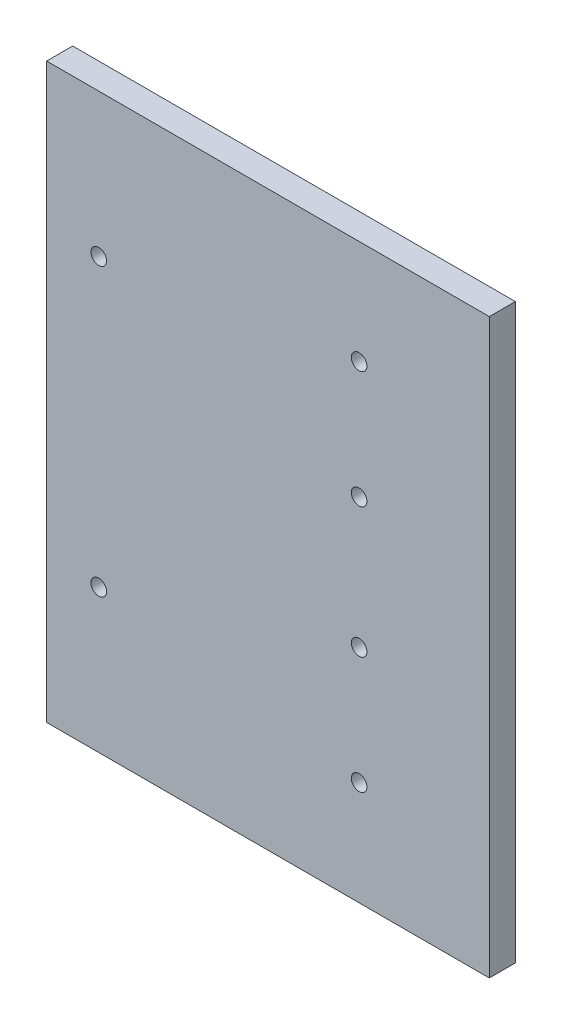
ISO-10303-21;
HEADER;
FILE_DESCRIPTION(('STEP AP214'),'2;1');
FILE_NAME('part.step','',(''),(''),'','','');
FILE_SCHEMA(('AUTOMOTIVE_DESIGN { 1 0 10303 214 1 1 1 1 }'));
ENDSEC;
DATA;
#1=APPLICATION_CONTEXT('core data for automotive mechanical design processes');
#2=APPLICATION_PROTOCOL_DEFINITION('international standard','automotive_design',2000,#1);
#3=PRODUCT_CONTEXT('',#1,'mechanical');
#4=PRODUCT('Part','Part','',(#3));
#5=PRODUCT_RELATED_PRODUCT_CATEGORY('part','',(#4));
#6=PRODUCT_DEFINITION_FORMATION('','',#4);
#7=PRODUCT_DEFINITION_CONTEXT('part definition',#1,'design');
#8=PRODUCT_DEFINITION('design','',#6,#7);
#9=PRODUCT_DEFINITION_SHAPE('','',#8);
#10=(LENGTH_UNIT() NAMED_UNIT(*) SI_UNIT(.MILLI.,.METRE.));
#11=(NAMED_UNIT(*) PLANE_ANGLE_UNIT() SI_UNIT($,.RADIAN.));
#12=(NAMED_UNIT(*) SI_UNIT($,.STERADIAN.) SOLID_ANGLE_UNIT());
#13=UNCERTAINTY_MEASURE_WITH_UNIT(LENGTH_MEASURE(1.E-05),#10,'distance_accuracy_value','');
#14=(GEOMETRIC_REPRESENTATION_CONTEXT(3) GLOBAL_UNCERTAINTY_ASSIGNED_CONTEXT((#13)) GLOBAL_UNIT_ASSIGNED_CONTEXT((#10,
#11,#12)) REPRESENTATION_CONTEXT('',''));
#15=CARTESIAN_POINT('',(0.,0.,0.));
#16=DIRECTION('',(0.,0.,1.));
#17=DIRECTION('',(1.,0.,0.));
#18=AXIS2_PLACEMENT_3D('',#15,#16,#17);
#19=CARTESIAN_POINT('',(-85.,-55.,5.));
#20=DIRECTION('',(1.,0.,0.));
#21=DIRECTION('',(0.,0.,-1.));
#22=AXIS2_PLACEMENT_3D('',#19,#20,#21);
#23=PLANE('',#22);
#24=DIRECTION('',(0.,-1.,0.));
#25=VECTOR('',#24,1.);
#26=CARTESIAN_POINT('',(-85.,-55.,0.));
#27=LINE('',#26,#25);
#28=CARTESIAN_POINT('',(-85.,55.,0.));
#29=VERTEX_POINT('',#28);
#30=CARTESIAN_POINT('',(-85.,-55.,0.));
#31=VERTEX_POINT('',#30);
#32=EDGE_CURVE('E86',#29,#31,#27,.T.);
#33=ORIENTED_EDGE('',*,*,#32,.T.);
#34=DIRECTION('',(0.,0.,-1.));
#35=VECTOR('',#34,1.);
#36=CARTESIAN_POINT('',(-85.,-55.,5.));
#37=LINE('',#36,#35);
#38=CARTESIAN_POINT('',(-85.,-55.,5.));
#39=VERTEX_POINT('',#38);
#40=EDGE_CURVE('E41',#39,#31,#37,.T.);
#41=ORIENTED_EDGE('',*,*,#40,.F.);
#42=DIRECTION('',(0.,-1.,0.));
#43=VECTOR('',#42,1.);
#44=CARTESIAN_POINT('',(-85.,-55.,5.));
#45=LINE('',#44,#43);
#46=CARTESIAN_POINT('',(-85.,55.,5.));
#47=VERTEX_POINT('',#46);
#48=EDGE_CURVE('E80',#47,#39,#45,.T.);
#49=ORIENTED_EDGE('',*,*,#48,.F.);
#50=DIRECTION('',(0.,0.,-1.));
#51=VECTOR('',#50,1.);
#52=CARTESIAN_POINT('',(-85.,55.,5.));
#53=LINE('',#52,#51);
#54=EDGE_CURVE('E73',#47,#29,#53,.T.);
#55=ORIENTED_EDGE('',*,*,#54,.T.);
#56=EDGE_LOOP('',(#33,#41,#49,#55));
#57=FACE_BOUND('',#56,.T.);
#58=ADVANCED_FACE('F34',(#57),#23,.F.);
#59=CARTESIAN_POINT('',(85.,-55.,5.));
#60=DIRECTION('',(0.,1.,0.));
#61=DIRECTION('',(-1.,0.,0.));
#62=AXIS2_PLACEMENT_3D('',#59,#60,#61);
#63=PLANE('',#62);
#64=DIRECTION('',(1.,0.,0.));
#65=VECTOR('',#64,1.);
#66=CARTESIAN_POINT('',(85.,-55.,0.));
#67=LINE('',#66,#65);
#68=CARTESIAN_POINT('',(0.,-55.,0.));
#69=VERTEX_POINT('',#68);
#70=EDGE_CURVE('E81',#31,#69,#67,.T.);
#71=ORIENTED_EDGE('',*,*,#70,.T.);
#72=DIRECTION('',(0.,0.,1.));
#73=VECTOR('',#72,1.);
#74=CARTESIAN_POINT('',(0.,-55.,5.));
#75=LINE('',#74,#73);
#76=CARTESIAN_POINT('',(0.,-55.,5.));
#77=VERTEX_POINT('',#76);
#78=EDGE_CURVE('E48',#69,#77,#75,.T.);
#79=ORIENTED_EDGE('',*,*,#78,.T.);
#80=DIRECTION('',(1.,0.,0.));
#81=VECTOR('',#80,1.);
#82=CARTESIAN_POINT('',(85.,-55.,5.));
#83=LINE('',#82,#81);
#84=EDGE_CURVE('E102',#39,#77,#83,.T.);
#85=ORIENTED_EDGE('',*,*,#84,.F.);
#86=ORIENTED_EDGE('',*,*,#40,.T.);
#87=EDGE_LOOP('',(#71,#79,#85,#86));
#88=FACE_BOUND('',#87,.T.);
#89=ADVANCED_FACE('F100',(#88),#63,.F.);
#90=CARTESIAN_POINT('',(85.,55.,5.));
#91=DIRECTION('',(0.,-1.,0.));
#92=DIRECTION('',(1.,0.,0.));
#93=AXIS2_PLACEMENT_3D('',#90,#91,#92);
#94=PLANE('',#93);
#95=DIRECTION('',(-1.,0.,0.));
#96=VECTOR('',#95,1.);
#97=CARTESIAN_POINT('',(85.,55.,5.));
#98=LINE('',#97,#96);
#99=CARTESIAN_POINT('',(0.,55.,5.));
#100=VERTEX_POINT('',#99);
#101=EDGE_CURVE('E56',#100,#47,#98,.T.);
#102=ORIENTED_EDGE('',*,*,#101,.F.);
#103=DIRECTION('',(0.,0.,-1.));
#104=VECTOR('',#103,1.);
#105=CARTESIAN_POINT('',(0.,55.,5.));
#106=LINE('',#105,#104);
#107=CARTESIAN_POINT('',(0.,55.,0.));
#108=VERTEX_POINT('',#107);
#109=EDGE_CURVE('E77',#100,#108,#106,.T.);
#110=ORIENTED_EDGE('',*,*,#109,.T.);
#111=DIRECTION('',(-1.,0.,0.));
#112=VECTOR('',#111,1.);
#113=CARTESIAN_POINT('',(85.,55.,0.));
#114=LINE('',#113,#112);
#115=EDGE_CURVE('E70',#108,#29,#114,.T.);
#116=ORIENTED_EDGE('',*,*,#115,.T.);
#117=ORIENTED_EDGE('',*,*,#54,.F.);
#118=EDGE_LOOP('',(#102,#110,#116,#117));
#119=FACE_BOUND('',#118,.T.);
#120=ADVANCED_FACE('F72',(#119),#94,.F.);
#121=CARTESIAN_POINT('',(0.,0.,5.));
#122=DIRECTION('',(0.,0.,1.));
#123=DIRECTION('',(1.,0.,0.));
#124=AXIS2_PLACEMENT_3D('',#121,#122,#123);
#125=PLANE('',#124);
#126=DIRECTION('',(0.,-1.,0.));
#127=VECTOR('',#126,1.);
#128=CARTESIAN_POINT('',(0.,0.,5.));
#129=LINE('',#128,#127);
#130=EDGE_CURVE('E126',#100,#77,#129,.T.);
#131=ORIENTED_EDGE('',*,*,#130,.F.);
#132=ORIENTED_EDGE('',*,*,#101,.T.);
#133=ORIENTED_EDGE('',*,*,#48,.T.);
#134=ORIENTED_EDGE('',*,*,#84,.T.);
#135=EDGE_LOOP('',(#131,#132,#133,#134));
#136=FACE_BOUND('',#135,.T.);
#137=CARTESIAN_POINT('',(-25.,12.5,5.));
#138=DIRECTION('',(0.,0.,1.));
#139=DIRECTION('',(-1.,0.,0.));
#140=AXIS2_PLACEMENT_3D('',#137,#138,#139);
#141=CIRCLE('',#140,1.5);
#142=CARTESIAN_POINT('',(-26.5,12.5,5.));
#143=VERTEX_POINT('',#142);
#144=EDGE_CURVE('E135',#143,#143,#141,.T.);
#145=ORIENTED_EDGE('',*,*,#144,.F.);
#146=EDGE_LOOP('',(#145));
#147=FACE_BOUND('',#146,.T.);
#148=CARTESIAN_POINT('',(-25.,-12.5,5.));
#149=DIRECTION('',(0.,0.,1.));
#150=DIRECTION('',(1.,0.,0.));
#151=AXIS2_PLACEMENT_3D('',#148,#149,#150);
#152=CIRCLE('',#151,1.5);
#153=CARTESIAN_POINT('',(-23.5,-12.5,5.));
#154=VERTEX_POINT('',#153);
#155=EDGE_CURVE('E129',#154,#154,#152,.T.);
#156=ORIENTED_EDGE('',*,*,#155,.F.);
#157=EDGE_LOOP('',(#156));
#158=FACE_BOUND('',#157,.T.);
#159=CARTESIAN_POINT('',(-25.,-35.,5.));
#160=DIRECTION('',(0.,0.,1.));
#161=DIRECTION('',(-1.,0.,0.));
#162=AXIS2_PLACEMENT_3D('',#159,#160,#161);
#163=CIRCLE('',#162,1.5);
#164=CARTESIAN_POINT('',(-26.5,-35.,5.));
#165=VERTEX_POINT('',#164);
#166=EDGE_CURVE('E122',#165,#165,#163,.T.);
#167=ORIENTED_EDGE('',*,*,#166,.F.);
#168=EDGE_LOOP('',(#167));
#169=FACE_BOUND('',#168,.T.);
#170=CARTESIAN_POINT('',(-25.,35.,5.));
#171=DIRECTION('',(0.,0.,1.));
#172=DIRECTION('',(1.,0.,0.));
#173=AXIS2_PLACEMENT_3D('',#170,#171,#172);
#174=CIRCLE('',#173,1.5);
#175=CARTESIAN_POINT('',(-23.5,35.,5.));
#176=VERTEX_POINT('',#175);
#177=EDGE_CURVE('E116',#176,#176,#174,.T.);
#178=ORIENTED_EDGE('',*,*,#177,.F.);
#179=EDGE_LOOP('',(#178));
#180=FACE_BOUND('',#179,.T.);
#181=CARTESIAN_POINT('',(-75.,-27.5,5.));
#182=DIRECTION('',(0.,0.,1.));
#183=DIRECTION('',(-1.,0.,0.));
#184=AXIS2_PLACEMENT_3D('',#181,#182,#183);
#185=CIRCLE('',#184,1.5);
#186=CARTESIAN_POINT('',(-76.5,-27.5,5.));
#187=VERTEX_POINT('',#186);
#188=EDGE_CURVE('E110',#187,#187,#185,.T.);
#189=ORIENTED_EDGE('',*,*,#188,.F.);
#190=EDGE_LOOP('',(#189));
#191=FACE_BOUND('',#190,.T.);
#192=CARTESIAN_POINT('',(-75.,27.5,5.));
#193=DIRECTION('',(0.,0.,1.));
#194=DIRECTION('',(1.,0.,0.));
#195=AXIS2_PLACEMENT_3D('',#192,#193,#194);
#196=CIRCLE('',#195,1.5);
#197=CARTESIAN_POINT('',(-73.5,27.5,5.));
#198=VERTEX_POINT('',#197);
#199=EDGE_CURVE('E95',#198,#198,#196,.T.);
#200=ORIENTED_EDGE('',*,*,#199,.F.);
#201=EDGE_LOOP('',(#200));
#202=FACE_BOUND('',#201,.T.);
#203=ADVANCED_FACE('F103',(#136,#147,#158,#169,#180,#191,#202),#125,.T.);
#204=CARTESIAN_POINT('',(0.,0.,0.));
#205=DIRECTION('',(0.,0.,1.));
#206=DIRECTION('',(1.,0.,0.));
#207=AXIS2_PLACEMENT_3D('',#204,#205,#206);
#208=PLANE('',#207);
#209=CARTESIAN_POINT('',(-25.,12.5,0.));
#210=DIRECTION('',(0.,0.,1.));
#211=DIRECTION('',(-1.,0.,0.));
#212=AXIS2_PLACEMENT_3D('',#209,#210,#211);
#213=CIRCLE('',#212,1.5);
#214=CARTESIAN_POINT('',(-26.5,12.5,0.));
#215=VERTEX_POINT('',#214);
#216=EDGE_CURVE('E119',#215,#215,#213,.T.);
#217=ORIENTED_EDGE('',*,*,#216,.T.);
#218=EDGE_LOOP('',(#217));
#219=FACE_BOUND('',#218,.T.);
#220=CARTESIAN_POINT('',(-25.,-12.5,0.));
#221=DIRECTION('',(0.,0.,1.));
#222=DIRECTION('',(1.,0.,0.));
#223=AXIS2_PLACEMENT_3D('',#220,#221,#222);
#224=CIRCLE('',#223,1.5);
#225=CARTESIAN_POINT('',(-23.5,-12.5,0.));
#226=VERTEX_POINT('',#225);
#227=EDGE_CURVE('E132',#226,#226,#224,.T.);
#228=ORIENTED_EDGE('',*,*,#227,.T.);
#229=EDGE_LOOP('',(#228));
#230=FACE_BOUND('',#229,.T.);
#231=CARTESIAN_POINT('',(-25.,-35.,0.));
#232=DIRECTION('',(0.,0.,1.));
#233=DIRECTION('',(-1.,0.,0.));
#234=AXIS2_PLACEMENT_3D('',#231,#232,#233);
#235=CIRCLE('',#234,1.5);
#236=CARTESIAN_POINT('',(-26.5,-35.,0.));
#237=VERTEX_POINT('',#236);
#238=EDGE_CURVE('E125',#237,#237,#235,.T.);
#239=ORIENTED_EDGE('',*,*,#238,.T.);
#240=EDGE_LOOP('',(#239));
#241=FACE_BOUND('',#240,.T.);
#242=CARTESIAN_POINT('',(-25.,35.,0.));
#243=DIRECTION('',(0.,0.,1.));
#244=DIRECTION('',(1.,0.,0.));
#245=AXIS2_PLACEMENT_3D('',#242,#243,#244);
#246=CIRCLE('',#245,1.5);
#247=CARTESIAN_POINT('',(-23.5,35.,0.));
#248=VERTEX_POINT('',#247);
#249=EDGE_CURVE('E113',#248,#248,#246,.T.);
#250=ORIENTED_EDGE('',*,*,#249,.T.);
#251=EDGE_LOOP('',(#250));
#252=FACE_BOUND('',#251,.T.);
#253=CARTESIAN_POINT('',(-75.,-27.5,0.));
#254=DIRECTION('',(0.,0.,1.));
#255=DIRECTION('',(-1.,0.,0.));
#256=AXIS2_PLACEMENT_3D('',#253,#254,#255);
#257=CIRCLE('',#256,1.5);
#258=CARTESIAN_POINT('',(-76.5,-27.5,0.));
#259=VERTEX_POINT('',#258);
#260=EDGE_CURVE('E108',#259,#259,#257,.T.);
#261=ORIENTED_EDGE('',*,*,#260,.T.);
#262=EDGE_LOOP('',(#261));
#263=FACE_BOUND('',#262,.T.);
#264=CARTESIAN_POINT('',(-75.,27.5,0.));
#265=DIRECTION('',(0.,0.,1.));
#266=DIRECTION('',(1.,0.,0.));
#267=AXIS2_PLACEMENT_3D('',#264,#265,#266);
#268=CIRCLE('',#267,1.5);
#269=CARTESIAN_POINT('',(-73.5,27.5,0.));
#270=VERTEX_POINT('',#269);
#271=EDGE_CURVE('E91',#270,#270,#268,.T.);
#272=ORIENTED_EDGE('',*,*,#271,.T.);
#273=EDGE_LOOP('',(#272));
#274=FACE_BOUND('',#273,.T.);
#275=ORIENTED_EDGE('',*,*,#115,.F.);
#276=DIRECTION('',(0.,-1.,0.));
#277=VECTOR('',#276,1.);
#278=CARTESIAN_POINT('',(0.,0.,0.));
#279=LINE('',#278,#277);
#280=EDGE_CURVE('E11',#108,#69,#279,.T.);
#281=ORIENTED_EDGE('',*,*,#280,.T.);
#282=ORIENTED_EDGE('',*,*,#70,.F.);
#283=ORIENTED_EDGE('',*,*,#32,.F.);
#284=EDGE_LOOP('',(#275,#281,#282,#283));
#285=FACE_BOUND('',#284,.T.);
#286=ADVANCED_FACE('F88',(#219,#230,#241,#252,#263,#274,#285),#208,.F.);
#287=CARTESIAN_POINT('',(-75.,27.5,0.));
#288=DIRECTION('',(0.,0.,1.));
#289=DIRECTION('',(1.,0.,0.));
#290=AXIS2_PLACEMENT_3D('',#287,#288,#289);
#291=CYLINDRICAL_SURFACE('',#290,1.5);
#292=ORIENTED_EDGE('',*,*,#271,.F.);
#293=EDGE_LOOP('',(#292));
#294=FACE_BOUND('',#293,.T.);
#295=ORIENTED_EDGE('',*,*,#199,.T.);
#296=EDGE_LOOP('',(#295));
#297=FACE_BOUND('',#296,.T.);
#298=ADVANCED_FACE('F166',(#294,#297),#291,.F.);
#299=CARTESIAN_POINT('',(-75.,-27.5,0.));
#300=DIRECTION('',(0.,0.,1.));
#301=DIRECTION('',(1.,0.,0.));
#302=AXIS2_PLACEMENT_3D('',#299,#300,#301);
#303=CYLINDRICAL_SURFACE('',#302,1.5);
#304=ORIENTED_EDGE('',*,*,#260,.F.);
#305=EDGE_LOOP('',(#304));
#306=FACE_BOUND('',#305,.T.);
#307=ORIENTED_EDGE('',*,*,#188,.T.);
#308=EDGE_LOOP('',(#307));
#309=FACE_BOUND('',#308,.T.);
#310=ADVANCED_FACE('F172',(#306,#309),#303,.F.);
#311=CARTESIAN_POINT('',(-25.,35.,0.));
#312=DIRECTION('',(0.,0.,1.));
#313=DIRECTION('',(1.,0.,0.));
#314=AXIS2_PLACEMENT_3D('',#311,#312,#313);
#315=CYLINDRICAL_SURFACE('',#314,1.5);
#316=ORIENTED_EDGE('',*,*,#249,.F.);
#317=EDGE_LOOP('',(#316));
#318=FACE_BOUND('',#317,.T.);
#319=ORIENTED_EDGE('',*,*,#177,.T.);
#320=EDGE_LOOP('',(#319));
#321=FACE_BOUND('',#320,.T.);
#322=ADVANCED_FACE('F176',(#318,#321),#315,.F.);
#323=CARTESIAN_POINT('',(-25.,-35.,0.));
#324=DIRECTION('',(0.,0.,1.));
#325=DIRECTION('',(1.,0.,0.));
#326=AXIS2_PLACEMENT_3D('',#323,#324,#325);
#327=CYLINDRICAL_SURFACE('',#326,1.5);
#328=ORIENTED_EDGE('',*,*,#238,.F.);
#329=EDGE_LOOP('',(#328));
#330=FACE_BOUND('',#329,.T.);
#331=ORIENTED_EDGE('',*,*,#166,.T.);
#332=EDGE_LOOP('',(#331));
#333=FACE_BOUND('',#332,.T.);
#334=ADVANCED_FACE('F180',(#330,#333),#327,.F.);
#335=CARTESIAN_POINT('',(-25.,-12.5,0.));
#336=DIRECTION('',(0.,0.,1.));
#337=DIRECTION('',(1.,0.,0.));
#338=AXIS2_PLACEMENT_3D('',#335,#336,#337);
#339=CYLINDRICAL_SURFACE('',#338,1.5);
#340=ORIENTED_EDGE('',*,*,#227,.F.);
#341=EDGE_LOOP('',(#340));
#342=FACE_BOUND('',#341,.T.);
#343=ORIENTED_EDGE('',*,*,#155,.T.);
#344=EDGE_LOOP('',(#343));
#345=FACE_BOUND('',#344,.T.);
#346=ADVANCED_FACE('F152',(#342,#345),#339,.F.);
#347=CARTESIAN_POINT('',(-25.,12.5,0.));
#348=DIRECTION('',(0.,0.,1.));
#349=DIRECTION('',(1.,0.,0.));
#350=AXIS2_PLACEMENT_3D('',#347,#348,#349);
#351=CYLINDRICAL_SURFACE('',#350,1.5);
#352=ORIENTED_EDGE('',*,*,#216,.F.);
#353=EDGE_LOOP('',(#352));
#354=FACE_BOUND('',#353,.T.);
#355=ORIENTED_EDGE('',*,*,#144,.T.);
#356=EDGE_LOOP('',(#355));
#357=FACE_BOUND('',#356,.T.);
#358=ADVANCED_FACE('F147',(#354,#357),#351,.F.);
#359=CARTESIAN_POINT('',(0.,0.,0.));
#360=DIRECTION('',(-1.,0.,0.));
#361=DIRECTION('',(0.,0.,1.));
#362=AXIS2_PLACEMENT_3D('',#359,#360,#361);
#363=PLANE('',#362);
#364=ORIENTED_EDGE('',*,*,#130,.T.);
#365=ORIENTED_EDGE('',*,*,#78,.F.);
#366=ORIENTED_EDGE('',*,*,#280,.F.);
#367=ORIENTED_EDGE('',*,*,#109,.F.);
#368=EDGE_LOOP('',(#364,#365,#366,#367));
#369=FACE_BOUND('',#368,.T.);
#370=ADVANCED_FACE('F142',(#369),#363,.F.);
#371=CLOSED_SHELL('',(#58,#89,#120,#203,#286,#298,#310,#322,#334,#346,#358,#370));
#372=MANIFOLD_SOLID_BREP('B2',#371);
#373=ADVANCED_BREP_SHAPE_REPRESENTATION('',(#18,#372),#14);
#374=SHAPE_DEFINITION_REPRESENTATION(#9,#373);
ENDSEC;
END-ISO-10303-21;
